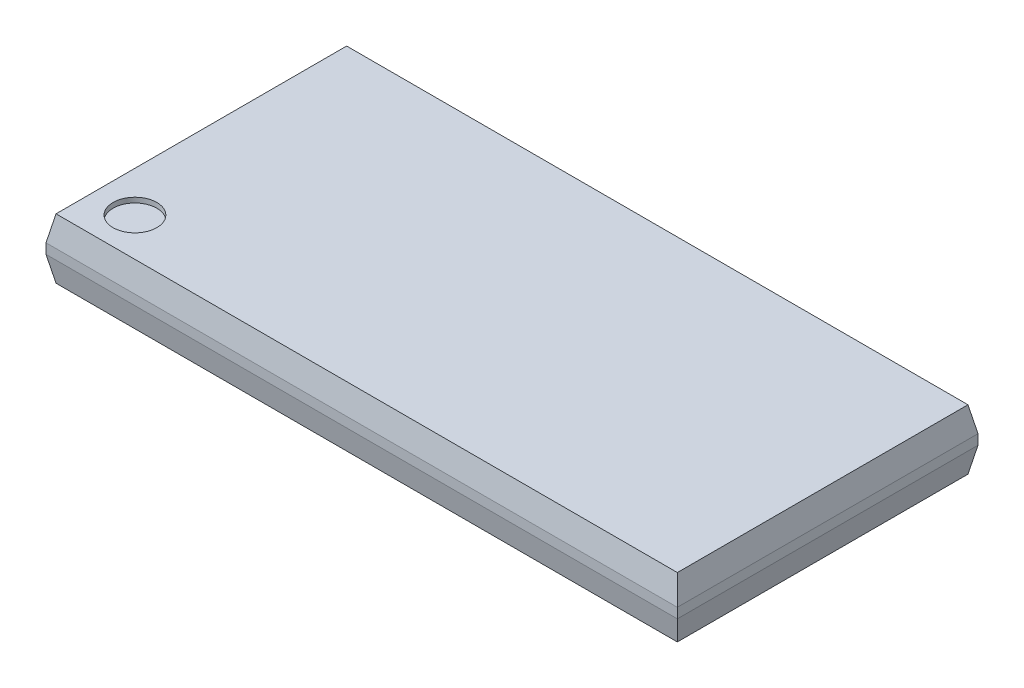
ISO-10303-21;
HEADER;
FILE_DESCRIPTION(('STEP AP214'),'2;1');
FILE_NAME('part.step','',(''),(''),'','','');
FILE_SCHEMA(('AUTOMOTIVE_DESIGN { 1 0 10303 214 1 1 1 1 }'));
ENDSEC;
DATA;
#1=APPLICATION_CONTEXT('core data for automotive mechanical design processes');
#2=APPLICATION_PROTOCOL_DEFINITION('international standard','automotive_design',2000,#1);
#3=PRODUCT_CONTEXT('',#1,'mechanical');
#4=PRODUCT('Part','Part','',(#3));
#5=PRODUCT_RELATED_PRODUCT_CATEGORY('part','',(#4));
#6=PRODUCT_DEFINITION_FORMATION('','',#4);
#7=PRODUCT_DEFINITION_CONTEXT('part definition',#1,'design');
#8=PRODUCT_DEFINITION('design','',#6,#7);
#9=PRODUCT_DEFINITION_SHAPE('','',#8);
#10=(LENGTH_UNIT() NAMED_UNIT(*) SI_UNIT(.MILLI.,.METRE.));
#11=(NAMED_UNIT(*) PLANE_ANGLE_UNIT() SI_UNIT($,.RADIAN.));
#12=(NAMED_UNIT(*) SI_UNIT($,.STERADIAN.) SOLID_ANGLE_UNIT());
#13=UNCERTAINTY_MEASURE_WITH_UNIT(LENGTH_MEASURE(1.E-05),#10,'distance_accuracy_value','');
#14=(GEOMETRIC_REPRESENTATION_CONTEXT(3) GLOBAL_UNCERTAINTY_ASSIGNED_CONTEXT((#13)) GLOBAL_UNIT_ASSIGNED_CONTEXT((#10,
#11,#12)) REPRESENTATION_CONTEXT('',''));
#15=CARTESIAN_POINT('',(0.,0.,0.));
#16=DIRECTION('',(0.,0.,1.));
#17=DIRECTION('',(1.,0.,0.));
#18=AXIS2_PLACEMENT_3D('',#15,#16,#17);
#19=CARTESIAN_POINT('',(0.,1.2,0.));
#20=DIRECTION('',(1.,0.,0.));
#21=DIRECTION('',(0.,0.,-1.));
#22=AXIS2_PLACEMENT_3D('',#19,#20,#21);
#23=PLANE('',#22);
#24=DIRECTION('',(0.,-1.,0.));
#25=VECTOR('',#24,1.);
#26=CARTESIAN_POINT('',(0.,1.2,-6.));
#27=LINE('',#26,#25);
#28=CARTESIAN_POINT('',(0.,0.699999999999994,-6.));
#29=VERTEX_POINT('',#28);
#30=CARTESIAN_POINT('',(0.,0.500000000000009,-6.));
#31=VERTEX_POINT('',#30);
#32=EDGE_CURVE('E173',#29,#31,#27,.T.);
#33=ORIENTED_EDGE('',*,*,#32,.T.);
#34=DIRECTION('',(0.,0.,1.));
#35=VECTOR('',#34,1.);
#36=CARTESIAN_POINT('',(0.,0.500000000000007,-0.0999999999999994));
#37=LINE('',#36,#35);
#38=CARTESIAN_POINT('',(0.,0.500000000000014,0.));
#39=VERTEX_POINT('',#38);
#40=EDGE_CURVE('E145',#31,#39,#37,.T.);
#41=ORIENTED_EDGE('',*,*,#40,.T.);
#42=DIRECTION('',(0.,-1.,0.));
#43=VECTOR('',#42,1.);
#44=CARTESIAN_POINT('',(0.,1.2,0.));
#45=LINE('',#44,#43);
#46=CARTESIAN_POINT('',(0.,0.699999999999989,0.));
#47=VERTEX_POINT('',#46);
#48=EDGE_CURVE('E118',#47,#39,#45,.T.);
#49=ORIENTED_EDGE('',*,*,#48,.F.);
#50=DIRECTION('',(0.,0.,-1.));
#51=VECTOR('',#50,1.);
#52=CARTESIAN_POINT('',(0.,0.699999999999989,0.));
#53=LINE('',#52,#51);
#54=EDGE_CURVE('E151',#47,#29,#53,.T.);
#55=ORIENTED_EDGE('',*,*,#54,.T.);
#56=EDGE_LOOP('',(#33,#41,#49,#55));
#57=FACE_BOUND('',#56,.T.);
#58=ADVANCED_FACE('F30',(#57),#23,.F.);
#59=CARTESIAN_POINT('',(0.,1.2,0.));
#60=DIRECTION('',(0.,0.,-1.));
#61=DIRECTION('',(-1.,0.,0.));
#62=AXIS2_PLACEMENT_3D('',#59,#60,#61);
#63=PLANE('',#62);
#64=ORIENTED_EDGE('',*,*,#48,.T.);
#65=DIRECTION('',(1.,0.,0.));
#66=VECTOR('',#65,1.);
#67=CARTESIAN_POINT('',(12.6,0.500000000000007,0.));
#68=LINE('',#67,#66);
#69=CARTESIAN_POINT('',(12.6,0.500000000000014,0.));
#70=VERTEX_POINT('',#69);
#71=EDGE_CURVE('E117',#39,#70,#68,.T.);
#72=ORIENTED_EDGE('',*,*,#71,.T.);
#73=DIRECTION('',(0.,-1.,0.));
#74=VECTOR('',#73,1.);
#75=CARTESIAN_POINT('',(12.6,1.2,0.));
#76=LINE('',#75,#74);
#77=CARTESIAN_POINT('',(12.6,0.699999999999989,0.));
#78=VERTEX_POINT('',#77);
#79=EDGE_CURVE('E99',#78,#70,#76,.T.);
#80=ORIENTED_EDGE('',*,*,#79,.F.);
#81=DIRECTION('',(-1.,0.,0.));
#82=VECTOR('',#81,1.);
#83=CARTESIAN_POINT('',(0.,0.699999999999989,0.));
#84=LINE('',#83,#82);
#85=EDGE_CURVE('E114',#78,#47,#84,.T.);
#86=ORIENTED_EDGE('',*,*,#85,.T.);
#87=EDGE_LOOP('',(#64,#72,#80,#86));
#88=FACE_BOUND('',#87,.T.);
#89=ADVANCED_FACE('F113',(#88),#63,.F.);
#90=CARTESIAN_POINT('',(12.6,1.2,0.));
#91=DIRECTION('',(-1.,0.,0.));
#92=DIRECTION('',(0.,0.,1.));
#93=AXIS2_PLACEMENT_3D('',#90,#91,#92);
#94=PLANE('',#93);
#95=ORIENTED_EDGE('',*,*,#79,.T.);
#96=DIRECTION('',(0.,0.,-1.));
#97=VECTOR('',#96,1.);
#98=CARTESIAN_POINT('',(12.6,0.500000000000007,-5.9));
#99=LINE('',#98,#97);
#100=CARTESIAN_POINT('',(12.6,0.500000000000009,-6.));
#101=VERTEX_POINT('',#100);
#102=EDGE_CURVE('E131',#70,#101,#99,.T.);
#103=ORIENTED_EDGE('',*,*,#102,.T.);
#104=DIRECTION('',(0.,-1.,0.));
#105=VECTOR('',#104,1.);
#106=CARTESIAN_POINT('',(12.6,1.2,-6.));
#107=LINE('',#106,#105);
#108=CARTESIAN_POINT('',(12.6,0.699999999999994,-6.));
#109=VERTEX_POINT('',#108);
#110=EDGE_CURVE('E102',#109,#101,#107,.T.);
#111=ORIENTED_EDGE('',*,*,#110,.F.);
#112=DIRECTION('',(0.,0.,1.));
#113=VECTOR('',#112,1.);
#114=CARTESIAN_POINT('',(12.6,0.699999999999996,0.));
#115=LINE('',#114,#113);
#116=EDGE_CURVE('E95',#109,#78,#115,.T.);
#117=ORIENTED_EDGE('',*,*,#116,.T.);
#118=EDGE_LOOP('',(#95,#103,#111,#117));
#119=FACE_BOUND('',#118,.T.);
#120=ADVANCED_FACE('F97',(#119),#94,.F.);
#121=CARTESIAN_POINT('',(0.,1.2,-6.));
#122=DIRECTION('',(0.,0.,1.));
#123=DIRECTION('',(1.,0.,0.));
#124=AXIS2_PLACEMENT_3D('',#121,#122,#123);
#125=PLANE('',#124);
#126=ORIENTED_EDGE('',*,*,#110,.T.);
#127=DIRECTION('',(-1.,0.,0.));
#128=VECTOR('',#127,1.);
#129=CARTESIAN_POINT('',(0.,0.500000000000009,-6.));
#130=LINE('',#129,#128);
#131=EDGE_CURVE('E159',#101,#31,#130,.T.);
#132=ORIENTED_EDGE('',*,*,#131,.T.);
#133=ORIENTED_EDGE('',*,*,#32,.F.);
#134=DIRECTION('',(1.,0.,0.));
#135=VECTOR('',#134,1.);
#136=CARTESIAN_POINT('',(0.,0.699999999999994,-6.));
#137=LINE('',#136,#135);
#138=EDGE_CURVE('E162',#29,#109,#137,.T.);
#139=ORIENTED_EDGE('',*,*,#138,.T.);
#140=EDGE_LOOP('',(#126,#132,#133,#139));
#141=FACE_BOUND('',#140,.T.);
#142=ADVANCED_FACE('F195',(#141),#125,.F.);
#143=CARTESIAN_POINT('',(0.,1.2,-6.));
#144=DIRECTION('',(0.,-1.,0.));
#145=DIRECTION('',(0.,0.,-1.));
#146=AXIS2_PLACEMENT_3D('',#143,#144,#145);
#147=PLANE('',#146);
#148=CARTESIAN_POINT('',(0.908756142823819,1.2,-0.866244746589473));
#149=DIRECTION('',(0.,1.,0.));
#150=DIRECTION('',(0.,0.,1.));
#151=AXIS2_PLACEMENT_3D('',#148,#149,#150);
#152=CIRCLE('',#151,0.436243036200276);
#153=CARTESIAN_POINT('',(0.908756142823819,1.2,-0.430001710389197));
#154=VERTEX_POINT('',#153);
#155=EDGE_CURVE('E177',#154,#154,#152,.T.);
#156=ORIENTED_EDGE('',*,*,#155,.F.);
#157=EDGE_LOOP('',(#156));
#158=FACE_BOUND('',#157,.T.);
#159=DIRECTION('',(1.,0.,0.));
#160=VECTOR('',#159,1.);
#161=CARTESIAN_POINT('',(0.,1.2,-0.100000000000001));
#162=LINE('',#161,#160);
#163=CARTESIAN_POINT('',(0.100000000000001,1.2,-0.100000000000001));
#164=VERTEX_POINT('',#163);
#165=CARTESIAN_POINT('',(12.5,1.2,-0.100000000000001));
#166=VERTEX_POINT('',#165);
#167=EDGE_CURVE('E125',#164,#166,#162,.T.);
#168=ORIENTED_EDGE('',*,*,#167,.T.);
#169=DIRECTION('',(0.,0.,-1.));
#170=VECTOR('',#169,1.);
#171=CARTESIAN_POINT('',(12.5,1.2,-6.));
#172=LINE('',#171,#170);
#173=CARTESIAN_POINT('',(12.5,1.2,-5.9));
#174=VERTEX_POINT('',#173);
#175=EDGE_CURVE('E130',#166,#174,#172,.T.);
#176=ORIENTED_EDGE('',*,*,#175,.T.);
#177=DIRECTION('',(-1.,0.,0.));
#178=VECTOR('',#177,1.);
#179=CARTESIAN_POINT('',(0.,1.2,-5.9));
#180=LINE('',#179,#178);
#181=CARTESIAN_POINT('',(0.100000000000001,1.2,-5.9));
#182=VERTEX_POINT('',#181);
#183=EDGE_CURVE('E165',#174,#182,#180,.T.);
#184=ORIENTED_EDGE('',*,*,#183,.T.);
#185=DIRECTION('',(0.,0.,1.));
#186=VECTOR('',#185,1.);
#187=CARTESIAN_POINT('',(0.100000000000001,1.2,-6.));
#188=LINE('',#187,#186);
#189=EDGE_CURVE('E154',#182,#164,#188,.T.);
#190=ORIENTED_EDGE('',*,*,#189,.T.);
#191=EDGE_LOOP('',(#168,#176,#184,#190));
#192=FACE_BOUND('',#191,.T.);
#193=ADVANCED_FACE('F191',(#158,#192),#147,.F.);
#194=CARTESIAN_POINT('',(0.,0.,-6.));
#195=DIRECTION('',(0.,-1.,0.));
#196=DIRECTION('',(0.,0.,-1.));
#197=AXIS2_PLACEMENT_3D('',#194,#195,#196);
#198=PLANE('',#197);
#199=DIRECTION('',(1.,0.,0.));
#200=VECTOR('',#199,1.);
#201=CARTESIAN_POINT('',(12.6,0.,-5.9));
#202=LINE('',#201,#200);
#203=CARTESIAN_POINT('',(0.0999999999999978,0.,-5.9));
#204=VERTEX_POINT('',#203);
#205=CARTESIAN_POINT('',(12.5,0.,-5.9));
#206=VERTEX_POINT('',#205);
#207=EDGE_CURVE('E157',#204,#206,#202,.T.);
#208=ORIENTED_EDGE('',*,*,#207,.T.);
#209=DIRECTION('',(0.,0.,1.));
#210=VECTOR('',#209,1.);
#211=CARTESIAN_POINT('',(12.5,0.,-0.0999999999999994));
#212=LINE('',#211,#210);
#213=CARTESIAN_POINT('',(12.5,0.,-0.0999999999999994));
#214=VERTEX_POINT('',#213);
#215=EDGE_CURVE('E38',#206,#214,#212,.T.);
#216=ORIENTED_EDGE('',*,*,#215,.T.);
#217=DIRECTION('',(-1.,0.,0.));
#218=VECTOR('',#217,1.);
#219=CARTESIAN_POINT('',(0.,0.,-0.0999999999999994));
#220=LINE('',#219,#218);
#221=CARTESIAN_POINT('',(0.0999999999999998,0.,-0.0999999999999994));
#222=VERTEX_POINT('',#221);
#223=EDGE_CURVE('E167',#214,#222,#220,.T.);
#224=ORIENTED_EDGE('',*,*,#223,.T.);
#225=DIRECTION('',(0.,0.,-1.));
#226=VECTOR('',#225,1.);
#227=CARTESIAN_POINT('',(0.0999999999999998,0.,-5.9));
#228=LINE('',#227,#226);
#229=EDGE_CURVE('E140',#222,#204,#228,.T.);
#230=ORIENTED_EDGE('',*,*,#229,.T.);
#231=EDGE_LOOP('',(#208,#216,#224,#230));
#232=FACE_BOUND('',#231,.T.);
#233=ADVANCED_FACE('F194',(#232),#198,.T.);
#234=CARTESIAN_POINT('',(0.,1.2,-0.100000000000001));
#235=DIRECTION('',(0.,-0.196116135138182,-0.980580675690921));
#236=DIRECTION('',(0.,0.980580675690921,-0.196116135138182));
#237=AXIS2_PLACEMENT_3D('',#234,#235,#236);
#238=PLANE('',#237);
#239=ORIENTED_EDGE('',*,*,#85,.F.);
#240=DIRECTION('',(-0.192450089729873,0.962250448649377,-0.192450089729873));
#241=VECTOR('',#240,1.);
#242=CARTESIAN_POINT('',(12.0370370370371,3.51481481481479,-0.562962962962954));
#243=LINE('',#242,#241);
#244=EDGE_CURVE('E105',#78,#166,#243,.T.);
#245=ORIENTED_EDGE('',*,*,#244,.T.);
#246=ORIENTED_EDGE('',*,*,#167,.F.);
#247=DIRECTION('',(-0.192450089729873,-0.962250448649377,0.192450089729873));
#248=VECTOR('',#247,1.);
#249=CARTESIAN_POINT('',(0.0962962962962971,1.18148148148148,-0.0962962962962975));
#250=LINE('',#249,#248);
#251=EDGE_CURVE('E124',#164,#47,#250,.T.);
#252=ORIENTED_EDGE('',*,*,#251,.T.);
#253=EDGE_LOOP('',(#239,#245,#246,#252));
#254=FACE_BOUND('',#253,.T.);
#255=ADVANCED_FACE('F121',(#254),#238,.F.);
#256=CARTESIAN_POINT('',(0.,0.500000000000007,0.));
#257=DIRECTION('',(0.,-0.19611613513818,0.980580675690921));
#258=DIRECTION('',(0.,-0.980580675690921,-0.19611613513818));
#259=AXIS2_PLACEMENT_3D('',#256,#257,#258);
#260=PLANE('',#259);
#261=ORIENTED_EDGE('',*,*,#223,.F.);
#262=DIRECTION('',(0.192450089729872,0.962250448649378,0.192450089729872));
#263=VECTOR('',#262,1.);
#264=CARTESIAN_POINT('',(12.1333333333334,-1.83333333333328,-0.466666666666649));
#265=LINE('',#264,#263);
#266=EDGE_CURVE('E11',#214,#70,#265,.T.);
#267=ORIENTED_EDGE('',*,*,#266,.T.);
#268=ORIENTED_EDGE('',*,*,#71,.F.);
#269=DIRECTION('',(0.192450089729872,-0.962250448649378,-0.192450089729872));
#270=VECTOR('',#269,1.);
#271=CARTESIAN_POINT('',(0.,0.500000000000007,0.));
#272=LINE('',#271,#270);
#273=EDGE_CURVE('E142',#39,#222,#272,.T.);
#274=ORIENTED_EDGE('',*,*,#273,.T.);
#275=EDGE_LOOP('',(#261,#267,#268,#274));
#276=FACE_BOUND('',#275,.T.);
#277=ADVANCED_FACE('F212',(#276),#260,.T.);
#278=CARTESIAN_POINT('',(0.,1.2,-5.9));
#279=DIRECTION('',(0.,-0.196116135138181,0.980580675690921));
#280=DIRECTION('',(0.,-0.980580675690921,-0.196116135138181));
#281=AXIS2_PLACEMENT_3D('',#278,#279,#280);
#282=PLANE('',#281);
#283=ORIENTED_EDGE('',*,*,#183,.F.);
#284=DIRECTION('',(0.192450089729873,-0.962250448649377,-0.192450089729872));
#285=VECTOR('',#284,1.);
#286=CARTESIAN_POINT('',(12.037037037037,3.51481481481479,-5.43703703703705));
#287=LINE('',#286,#285);
#288=EDGE_CURVE('E106',#174,#109,#287,.T.);
#289=ORIENTED_EDGE('',*,*,#288,.T.);
#290=ORIENTED_EDGE('',*,*,#138,.F.);
#291=DIRECTION('',(0.192450089729873,0.962250448649377,0.192450089729872));
#292=VECTOR('',#291,1.);
#293=CARTESIAN_POINT('',(0.0962962962962971,1.18148148148148,-5.9037037037037));
#294=LINE('',#293,#292);
#295=EDGE_CURVE('E148',#29,#182,#294,.T.);
#296=ORIENTED_EDGE('',*,*,#295,.T.);
#297=EDGE_LOOP('',(#283,#289,#290,#296));
#298=FACE_BOUND('',#297,.T.);
#299=ADVANCED_FACE('F209',(#298),#282,.F.);
#300=CARTESIAN_POINT('',(0.,0.500000000000009,-6.));
#301=DIRECTION('',(0.,-0.196116135138181,-0.980580675690921));
#302=DIRECTION('',(0.,0.980580675690921,-0.196116135138181));
#303=AXIS2_PLACEMENT_3D('',#300,#301,#302);
#304=PLANE('',#303);
#305=ORIENTED_EDGE('',*,*,#131,.F.);
#306=DIRECTION('',(-0.192450089729872,-0.962250448649377,0.192450089729872));
#307=VECTOR('',#306,1.);
#308=CARTESIAN_POINT('',(12.1333333333334,-1.83333333333328,-5.53333333333335));
#309=LINE('',#308,#307);
#310=EDGE_CURVE('E52',#101,#206,#309,.T.);
#311=ORIENTED_EDGE('',*,*,#310,.T.);
#312=ORIENTED_EDGE('',*,*,#207,.F.);
#313=DIRECTION('',(-0.192450089729872,0.962250448649377,-0.192450089729872));
#314=VECTOR('',#313,1.);
#315=CARTESIAN_POINT('',(0.,0.500000000000009,-6.));
#316=LINE('',#315,#314);
#317=EDGE_CURVE('E138',#204,#31,#316,.T.);
#318=ORIENTED_EDGE('',*,*,#317,.T.);
#319=EDGE_LOOP('',(#305,#311,#312,#318));
#320=FACE_BOUND('',#319,.T.);
#321=ADVANCED_FACE('F211',(#320),#304,.T.);
#322=CARTESIAN_POINT('',(0.100000000000001,1.2,-6.));
#323=DIRECTION('',(0.980580675690921,-0.196116135138181,0.));
#324=DIRECTION('',(0.196116135138181,0.980580675690921,0.));
#325=AXIS2_PLACEMENT_3D('',#322,#323,#324);
#326=PLANE('',#325);
#327=ORIENTED_EDGE('',*,*,#295,.F.);
#328=ORIENTED_EDGE('',*,*,#54,.F.);
#329=ORIENTED_EDGE('',*,*,#251,.F.);
#330=ORIENTED_EDGE('',*,*,#189,.F.);
#331=EDGE_LOOP('',(#327,#328,#329,#330));
#332=FACE_BOUND('',#331,.T.);
#333=ADVANCED_FACE('F201',(#332),#326,.F.);
#334=CARTESIAN_POINT('',(0.,0.500000000000007,0.));
#335=DIRECTION('',(-0.980580675690921,-0.196116135138181,0.));
#336=DIRECTION('',(0.196116135138181,-0.980580675690921,0.));
#337=AXIS2_PLACEMENT_3D('',#334,#335,#336);
#338=PLANE('',#337);
#339=ORIENTED_EDGE('',*,*,#317,.F.);
#340=ORIENTED_EDGE('',*,*,#229,.F.);
#341=ORIENTED_EDGE('',*,*,#273,.F.);
#342=ORIENTED_EDGE('',*,*,#40,.F.);
#343=EDGE_LOOP('',(#339,#340,#341,#342));
#344=FACE_BOUND('',#343,.T.);
#345=ADVANCED_FACE('F281',(#344),#338,.T.);
#346=CARTESIAN_POINT('',(12.5,1.2,-6.));
#347=DIRECTION('',(-0.980580675690921,-0.196116135138181,0.));
#348=DIRECTION('',(0.196116135138181,-0.980580675690921,0.));
#349=AXIS2_PLACEMENT_3D('',#346,#347,#348);
#350=PLANE('',#349);
#351=ORIENTED_EDGE('',*,*,#244,.F.);
#352=ORIENTED_EDGE('',*,*,#116,.F.);
#353=ORIENTED_EDGE('',*,*,#288,.F.);
#354=ORIENTED_EDGE('',*,*,#175,.F.);
#355=EDGE_LOOP('',(#351,#352,#353,#354));
#356=FACE_BOUND('',#355,.T.);
#357=ADVANCED_FACE('F128',(#356),#350,.F.);
#358=CARTESIAN_POINT('',(12.6,0.500000000000007,0.));
#359=DIRECTION('',(0.980580675690921,-0.19611613513818,0.));
#360=DIRECTION('',(0.19611613513818,0.980580675690921,0.));
#361=AXIS2_PLACEMENT_3D('',#358,#359,#360);
#362=PLANE('',#361);
#363=ORIENTED_EDGE('',*,*,#266,.F.);
#364=ORIENTED_EDGE('',*,*,#215,.F.);
#365=ORIENTED_EDGE('',*,*,#310,.F.);
#366=ORIENTED_EDGE('',*,*,#102,.F.);
#367=EDGE_LOOP('',(#363,#364,#365,#366));
#368=FACE_BOUND('',#367,.T.);
#369=ADVANCED_FACE('F32',(#368),#362,.T.);
#370=CARTESIAN_POINT('',(0.908756142823819,1.1,-0.866244746589473));
#371=DIRECTION('',(0.,1.,0.));
#372=DIRECTION('',(0.,0.,1.));
#373=AXIS2_PLACEMENT_3D('',#370,#371,#372);
#374=CYLINDRICAL_SURFACE('',#373,0.436243036200276);
#375=CARTESIAN_POINT('',(0.908756142823819,1.1,-0.866244746589473));
#376=DIRECTION('',(0.,1.,0.));
#377=DIRECTION('',(0.,0.,1.));
#378=AXIS2_PLACEMENT_3D('',#375,#376,#377);
#379=CIRCLE('',#378,0.436243036200276);
#380=CARTESIAN_POINT('',(0.908756142823819,1.1,-0.430001710389197));
#381=VERTEX_POINT('',#380);
#382=EDGE_CURVE('E176',#381,#381,#379,.T.);
#383=ORIENTED_EDGE('',*,*,#382,.F.);
#384=EDGE_LOOP('',(#383));
#385=FACE_BOUND('',#384,.T.);
#386=ORIENTED_EDGE('',*,*,#155,.T.);
#387=EDGE_LOOP('',(#386));
#388=FACE_BOUND('',#387,.T.);
#389=ADVANCED_FACE('F185',(#385,#388),#374,.F.);
#390=CARTESIAN_POINT('',(0.908756142823819,1.1,-0.866244746589473));
#391=DIRECTION('',(0.,1.,0.));
#392=DIRECTION('',(0.,0.,1.));
#393=AXIS2_PLACEMENT_3D('',#390,#391,#392);
#394=PLANE('',#393);
#395=ORIENTED_EDGE('',*,*,#382,.T.);
#396=EDGE_LOOP('',(#395));
#397=FACE_BOUND('',#396,.T.);
#398=ADVANCED_FACE('F183',(#397),#394,.T.);
#399=CLOSED_SHELL('',(#58,#89,#120,#142,#193,#233,#255,#277,#299,#321,#333,#345,#357,#369,#389,#398));
#400=MANIFOLD_SOLID_BREP('B2',#399);
#401=ADVANCED_BREP_SHAPE_REPRESENTATION('',(#18,#400),#14);
#402=SHAPE_DEFINITION_REPRESENTATION(#9,#401);
ENDSEC;
END-ISO-10303-21;
